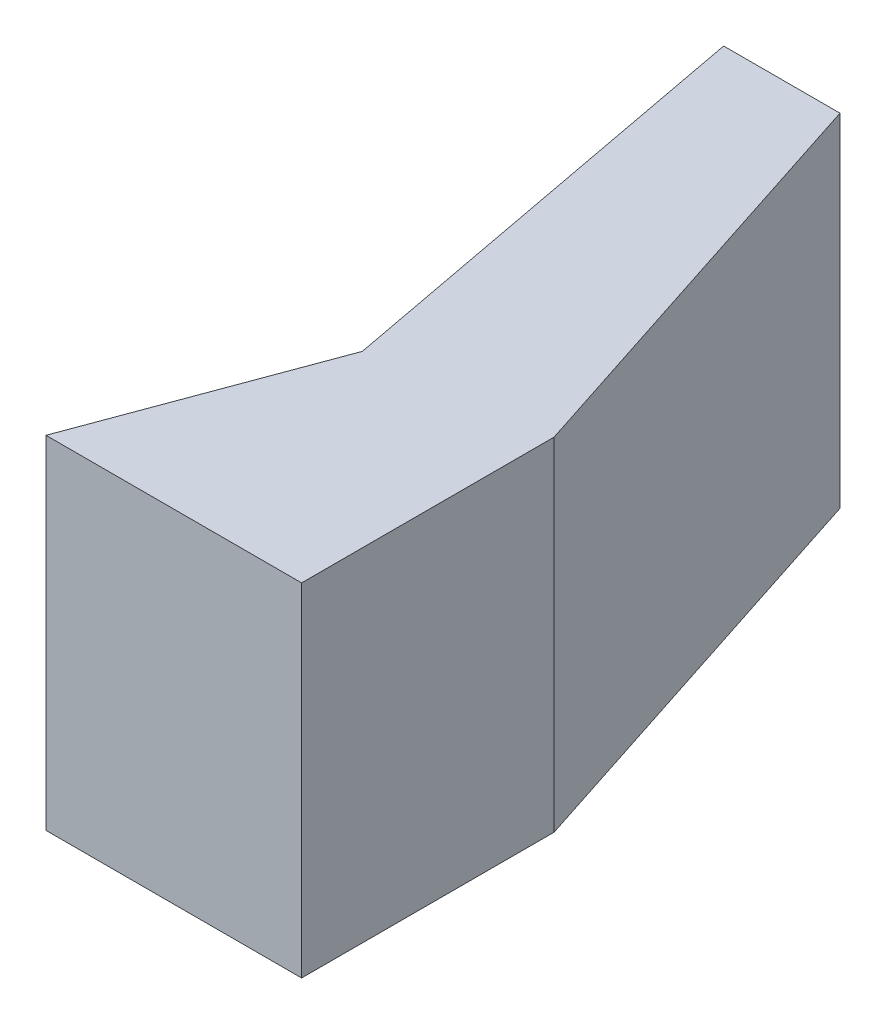
ISO-10303-21;
HEADER;
FILE_DESCRIPTION(('STEP AP214'),'2;1');
FILE_NAME('part.step','',(''),(''),'','','');
FILE_SCHEMA(('AUTOMOTIVE_DESIGN { 1 0 10303 214 1 1 1 1 }'));
ENDSEC;
DATA;
#1=APPLICATION_CONTEXT('core data for automotive mechanical design processes');
#2=APPLICATION_PROTOCOL_DEFINITION('international standard','automotive_design',2000,#1);
#3=PRODUCT_CONTEXT('',#1,'mechanical');
#4=PRODUCT('Part','Part','',(#3));
#5=PRODUCT_RELATED_PRODUCT_CATEGORY('part','',(#4));
#6=PRODUCT_DEFINITION_FORMATION('','',#4);
#7=PRODUCT_DEFINITION_CONTEXT('part definition',#1,'design');
#8=PRODUCT_DEFINITION('design','',#6,#7);
#9=PRODUCT_DEFINITION_SHAPE('','',#8);
#10=(LENGTH_UNIT() NAMED_UNIT(*) SI_UNIT(.MILLI.,.METRE.));
#11=(NAMED_UNIT(*) PLANE_ANGLE_UNIT() SI_UNIT($,.RADIAN.));
#12=(NAMED_UNIT(*) SI_UNIT($,.STERADIAN.) SOLID_ANGLE_UNIT());
#13=UNCERTAINTY_MEASURE_WITH_UNIT(LENGTH_MEASURE(1.E-05),#10,'distance_accuracy_value','');
#14=(GEOMETRIC_REPRESENTATION_CONTEXT(3) GLOBAL_UNCERTAINTY_ASSIGNED_CONTEXT((#13)) GLOBAL_UNIT_ASSIGNED_CONTEXT((#10,
#11,#12)) REPRESENTATION_CONTEXT('',''));
#15=CARTESIAN_POINT('',(0.,0.,0.));
#16=DIRECTION('',(0.,0.,1.));
#17=DIRECTION('',(1.,0.,0.));
#18=AXIS2_PLACEMENT_3D('',#15,#16,#17);
#19=CARTESIAN_POINT('',(0.,0.,0.));
#20=DIRECTION('',(0.,-1.,0.));
#21=DIRECTION('',(0.,0.,-1.));
#22=AXIS2_PLACEMENT_3D('',#19,#20,#21);
#23=PLANE('',#22);
#24=DIRECTION('',(0.,0.,-1.));
#25=VECTOR('',#24,1.);
#26=CARTESIAN_POINT('',(23.002372200557,0.,-14.192126517734));
#27=LINE('',#26,#25);
#28=CARTESIAN_POINT('',(23.002372200557,0.,47.057873482266));
#29=VERTEX_POINT('',#28);
#30=CARTESIAN_POINT('',(23.002372200557,0.,-14.192126517734));
#31=VERTEX_POINT('',#30);
#32=EDGE_CURVE('E205',#29,#31,#27,.T.);
#33=ORIENTED_EDGE('',*,*,#32,.F.);
#34=DIRECTION('',(1.,0.,0.));
#35=VECTOR('',#34,1.);
#36=CARTESIAN_POINT('',(23.002372200557,0.,47.057873482266));
#37=LINE('',#36,#35);
#38=CARTESIAN_POINT('',(-38.997627799443,0.,47.057873482266));
#39=VERTEX_POINT('',#38);
#40=EDGE_CURVE('E58',#39,#29,#37,.T.);
#41=ORIENTED_EDGE('',*,*,#40,.F.);
#42=DIRECTION('',(-0.347263015428623,0.,0.937767774086644));
#43=VECTOR('',#42,1.);
#44=CARTESIAN_POINT('',(-38.997627799443,0.,47.057873482266));
#45=LINE('',#44,#43);
#46=CARTESIAN_POINT('',(-18.2646737230859,0.,-8.93051379366682));
#47=VERTEX_POINT('',#46);
#48=EDGE_CURVE('E133',#47,#39,#45,.T.);
#49=ORIENTED_EDGE('',*,*,#48,.F.);
#50=DIRECTION('',(0.184980577052595,0.,0.982742176826297));
#51=VECTOR('',#50,1.);
#52=CARTESIAN_POINT('',(-18.2646737230859,0.,-8.93051379366682));
#53=LINE('',#52,#51);
#54=CARTESIAN_POINT('',(-38.5888348447447,0.,-116.906230277611));
#55=VERTEX_POINT('',#54);
#56=EDGE_CURVE('E212',#55,#47,#53,.T.);
#57=ORIENTED_EDGE('',*,*,#56,.F.);
#58=DIRECTION('',(-1.,0.,0.));
#59=VECTOR('',#58,1.);
#60=CARTESIAN_POINT('',(-38.5888348447447,0.,-116.906230277611));
#61=LINE('',#60,#59);
#62=CARTESIAN_POINT('',(-10.3714631919374,0.,-116.906230277611));
#63=VERTEX_POINT('',#62);
#64=EDGE_CURVE('E210',#63,#55,#61,.T.);
#65=ORIENTED_EDGE('',*,*,#64,.F.);
#66=DIRECTION('',(-0.309016994374949,0.,-0.951056516295153));
#67=VECTOR('',#66,1.);
#68=CARTESIAN_POINT('',(-10.3714631919374,0.,-116.906230277611));
#69=LINE('',#68,#67);
#70=EDGE_CURVE('E208',#31,#63,#69,.T.);
#71=ORIENTED_EDGE('',*,*,#70,.F.);
#72=EDGE_LOOP('',(#33,#41,#49,#57,#65,#71));
#73=FACE_BOUND('',#72,.T.);
#74=DIRECTION('',(0.184980577052596,0.,0.982742176826297));
#75=VECTOR('',#74,1.);
#76=CARTESIAN_POINT('',(-36.177255073376,0.,-114.906230277611));
#77=LINE('',#76,#75);
#78=CARTESIAN_POINT('',(-36.177255073376,0.,-114.906230277611));
#79=VERTEX_POINT('',#78);
#80=CARTESIAN_POINT('',(-16.1966595941276,0.,-8.75576730235923));
#81=VERTEX_POINT('',#80);
#82=EDGE_CURVE('E163',#79,#81,#77,.T.);
#83=ORIENTED_EDGE('',*,*,#82,.T.);
#84=DIRECTION('',(-0.347263015428623,0.,0.937767774086645));
#85=VECTOR('',#84,1.);
#86=CARTESIAN_POINT('',(-16.1966595941276,0.,-8.75576730235923));
#87=LINE('',#86,#85);
#88=CARTESIAN_POINT('',(-36.1242873997032,0.,45.057873482266));
#89=VERTEX_POINT('',#88);
#90=EDGE_CURVE('E50',#81,#89,#87,.T.);
#91=ORIENTED_EDGE('',*,*,#90,.T.);
#92=DIRECTION('',(1.,0.,0.));
#93=VECTOR('',#92,1.);
#94=CARTESIAN_POINT('',(-36.1242873997032,0.,45.057873482266));
#95=LINE('',#94,#93);
#96=CARTESIAN_POINT('',(21.002372200557,0.,45.057873482266));
#97=VERTEX_POINT('',#96);
#98=EDGE_CURVE('E180',#89,#97,#95,.T.);
#99=ORIENTED_EDGE('',*,*,#98,.T.);
#100=DIRECTION('',(0.,0.,-1.));
#101=VECTOR('',#100,1.);
#102=CARTESIAN_POINT('',(21.002372200557,0.,45.057873482266));
#103=LINE('',#102,#101);
#104=CARTESIAN_POINT('',(21.002372200557,0.,-13.8753576370849));
#105=VERTEX_POINT('',#104);
#106=EDGE_CURVE('E183',#97,#105,#103,.T.);
#107=ORIENTED_EDGE('',*,*,#106,.T.);
#108=DIRECTION('',(-0.309016994374949,0.,-0.951056516295153));
#109=VECTOR('',#108,1.);
#110=CARTESIAN_POINT('',(21.002372200557,0.,-13.8753576370849));
#111=LINE('',#110,#109);
#112=CARTESIAN_POINT('',(-11.8245482479482,0.,-114.906230277611));
#113=VERTEX_POINT('',#112);
#114=EDGE_CURVE('E186',#105,#113,#111,.T.);
#115=ORIENTED_EDGE('',*,*,#114,.T.);
#116=DIRECTION('',(-1.,0.,0.));
#117=VECTOR('',#116,1.);
#118=CARTESIAN_POINT('',(-11.8245482479482,0.,-114.906230277611));
#119=LINE('',#118,#117);
#120=EDGE_CURVE('E189',#113,#79,#119,.T.);
#121=ORIENTED_EDGE('',*,*,#120,.T.);
#122=EDGE_LOOP('',(#83,#91,#99,#107,#115,#121));
#123=FACE_BOUND('',#122,.T.);
#124=ADVANCED_FACE('F35',(#73,#123),#23,.T.);
#125=CARTESIAN_POINT('',(23.002372200557,81.,-14.192126517734));
#126=DIRECTION('',(-1.,0.,0.));
#127=DIRECTION('',(0.,0.,1.));
#128=AXIS2_PLACEMENT_3D('',#125,#126,#127);
#129=PLANE('',#128);
#130=ORIENTED_EDGE('',*,*,#32,.T.);
#131=DIRECTION('',(0.,-1.,0.));
#132=VECTOR('',#131,1.);
#133=CARTESIAN_POINT('',(23.002372200557,81.,-14.192126517734));
#134=LINE('',#133,#132);
#135=CARTESIAN_POINT('',(23.002372200557,83.,-14.192126517734));
#136=VERTEX_POINT('',#135);
#137=EDGE_CURVE('E11',#136,#31,#134,.T.);
#138=ORIENTED_EDGE('',*,*,#137,.F.);
#139=DIRECTION('',(0.,0.,-1.));
#140=VECTOR('',#139,1.);
#141=CARTESIAN_POINT('',(23.002372200557,83.,47.057873482266));
#142=LINE('',#141,#140);
#143=CARTESIAN_POINT('',(23.002372200557,83.,47.057873482266));
#144=VERTEX_POINT('',#143);
#145=EDGE_CURVE('E143',#144,#136,#142,.T.);
#146=ORIENTED_EDGE('',*,*,#145,.F.);
#147=DIRECTION('',(0.,-1.,0.));
#148=VECTOR('',#147,1.);
#149=CARTESIAN_POINT('',(23.002372200557,81.,47.057873482266));
#150=LINE('',#149,#148);
#151=EDGE_CURVE('E135',#144,#29,#150,.T.);
#152=ORIENTED_EDGE('',*,*,#151,.T.);
#153=EDGE_LOOP('',(#130,#138,#146,#152));
#154=FACE_BOUND('',#153,.T.);
#155=ADVANCED_FACE('F37',(#154),#129,.F.);
#156=CARTESIAN_POINT('',(-10.3714631919374,81.,-116.906230277611));
#157=DIRECTION('',(-0.951056516295153,0.,0.309016994374949));
#158=DIRECTION('',(0.309016994374949,0.,0.951056516295153));
#159=AXIS2_PLACEMENT_3D('',#156,#157,#158);
#160=PLANE('',#159);
#161=ORIENTED_EDGE('',*,*,#70,.T.);
#162=DIRECTION('',(0.,-1.,0.));
#163=VECTOR('',#162,1.);
#164=CARTESIAN_POINT('',(-10.3714631919374,81.,-116.906230277611));
#165=LINE('',#164,#163);
#166=CARTESIAN_POINT('',(-10.3714631919374,83.,-116.906230277611));
#167=VERTEX_POINT('',#166);
#168=EDGE_CURVE('E43',#167,#63,#165,.T.);
#169=ORIENTED_EDGE('',*,*,#168,.F.);
#170=DIRECTION('',(-0.309016994374949,0.,-0.951056516295153));
#171=VECTOR('',#170,1.);
#172=CARTESIAN_POINT('',(23.002372200557,83.,-14.192126517734));
#173=LINE('',#172,#171);
#174=EDGE_CURVE('E153',#136,#167,#173,.T.);
#175=ORIENTED_EDGE('',*,*,#174,.F.);
#176=ORIENTED_EDGE('',*,*,#137,.T.);
#177=EDGE_LOOP('',(#161,#169,#175,#176));
#178=FACE_BOUND('',#177,.T.);
#179=ADVANCED_FACE('F233',(#178),#160,.F.);
#180=CARTESIAN_POINT('',(-38.5888348447447,81.,-116.906230277611));
#181=DIRECTION('',(0.,0.,1.));
#182=DIRECTION('',(1.,0.,0.));
#183=AXIS2_PLACEMENT_3D('',#180,#181,#182);
#184=PLANE('',#183);
#185=ORIENTED_EDGE('',*,*,#64,.T.);
#186=DIRECTION('',(0.,-1.,0.));
#187=VECTOR('',#186,1.);
#188=CARTESIAN_POINT('',(-38.5888348447447,81.,-116.906230277611));
#189=LINE('',#188,#187);
#190=CARTESIAN_POINT('',(-38.5888348447447,83.,-116.906230277611));
#191=VERTEX_POINT('',#190);
#192=EDGE_CURVE('E218',#191,#55,#189,.T.);
#193=ORIENTED_EDGE('',*,*,#192,.F.);
#194=DIRECTION('',(-1.,0.,0.));
#195=VECTOR('',#194,1.);
#196=CARTESIAN_POINT('',(-10.3714631919374,83.,-116.906230277611));
#197=LINE('',#196,#195);
#198=EDGE_CURVE('E156',#167,#191,#197,.T.);
#199=ORIENTED_EDGE('',*,*,#198,.F.);
#200=ORIENTED_EDGE('',*,*,#168,.T.);
#201=EDGE_LOOP('',(#185,#193,#199,#200));
#202=FACE_BOUND('',#201,.T.);
#203=ADVANCED_FACE('F224',(#202),#184,.F.);
#204=CARTESIAN_POINT('',(-18.2646737230859,81.,-8.93051379366682));
#205=DIRECTION('',(0.982742176826297,0.,-0.184980577052595));
#206=DIRECTION('',(-0.184980577052595,0.,-0.982742176826297));
#207=AXIS2_PLACEMENT_3D('',#204,#205,#206);
#208=PLANE('',#207);
#209=ORIENTED_EDGE('',*,*,#56,.T.);
#210=DIRECTION('',(0.,-1.,0.));
#211=VECTOR('',#210,1.);
#212=CARTESIAN_POINT('',(-18.2646737230859,81.,-8.93051379366682));
#213=LINE('',#212,#211);
#214=CARTESIAN_POINT('',(-18.2646737230859,83.,-8.93051379366682));
#215=VERTEX_POINT('',#214);
#216=EDGE_CURVE('E134',#215,#47,#213,.T.);
#217=ORIENTED_EDGE('',*,*,#216,.F.);
#218=DIRECTION('',(0.184980577052595,0.,0.982742176826297));
#219=VECTOR('',#218,1.);
#220=CARTESIAN_POINT('',(-38.5888348447447,83.,-116.906230277611));
#221=LINE('',#220,#219);
#222=EDGE_CURVE('E149',#191,#215,#221,.T.);
#223=ORIENTED_EDGE('',*,*,#222,.F.);
#224=ORIENTED_EDGE('',*,*,#192,.T.);
#225=EDGE_LOOP('',(#209,#217,#223,#224));
#226=FACE_BOUND('',#225,.T.);
#227=ADVANCED_FACE('F232',(#226),#208,.F.);
#228=CARTESIAN_POINT('',(-38.997627799443,81.,47.057873482266));
#229=DIRECTION('',(0.937767774086645,0.,0.347263015428623));
#230=DIRECTION('',(0.347263015428623,0.,-0.937767774086645));
#231=AXIS2_PLACEMENT_3D('',#228,#229,#230);
#232=PLANE('',#231);
#233=ORIENTED_EDGE('',*,*,#48,.T.);
#234=DIRECTION('',(0.,-1.,0.));
#235=VECTOR('',#234,1.);
#236=CARTESIAN_POINT('',(-38.997627799443,81.,47.057873482266));
#237=LINE('',#236,#235);
#238=CARTESIAN_POINT('',(-38.997627799443,83.,47.057873482266));
#239=VERTEX_POINT('',#238);
#240=EDGE_CURVE('E126',#239,#39,#237,.T.);
#241=ORIENTED_EDGE('',*,*,#240,.F.);
#242=DIRECTION('',(-0.347263015428623,0.,0.937767774086644));
#243=VECTOR('',#242,1.);
#244=CARTESIAN_POINT('',(-18.2646737230859,83.,-8.93051379366682));
#245=LINE('',#244,#243);
#246=EDGE_CURVE('E131',#215,#239,#245,.T.);
#247=ORIENTED_EDGE('',*,*,#246,.F.);
#248=ORIENTED_EDGE('',*,*,#216,.T.);
#249=EDGE_LOOP('',(#233,#241,#247,#248));
#250=FACE_BOUND('',#249,.T.);
#251=ADVANCED_FACE('F128',(#250),#232,.F.);
#252=CARTESIAN_POINT('',(23.002372200557,81.,47.057873482266));
#253=DIRECTION('',(0.,0.,-1.));
#254=DIRECTION('',(-1.,0.,0.));
#255=AXIS2_PLACEMENT_3D('',#252,#253,#254);
#256=PLANE('',#255);
#257=ORIENTED_EDGE('',*,*,#40,.T.);
#258=ORIENTED_EDGE('',*,*,#151,.F.);
#259=DIRECTION('',(1.,0.,0.));
#260=VECTOR('',#259,1.);
#261=CARTESIAN_POINT('',(-38.997627799443,83.,47.057873482266));
#262=LINE('',#261,#260);
#263=EDGE_CURVE('E138',#239,#144,#262,.T.);
#264=ORIENTED_EDGE('',*,*,#263,.F.);
#265=ORIENTED_EDGE('',*,*,#240,.T.);
#266=EDGE_LOOP('',(#257,#258,#264,#265));
#267=FACE_BOUND('',#266,.T.);
#268=ADVANCED_FACE('F139',(#267),#256,.F.);
#269=CARTESIAN_POINT('',(-16.1966595941276,81.,-8.75576730235923));
#270=DIRECTION('',(0.937767774086645,0.,0.347263015428623));
#271=DIRECTION('',(0.347263015428623,0.,-0.937767774086645));
#272=AXIS2_PLACEMENT_3D('',#269,#270,#271);
#273=PLANE('',#272);
#274=ORIENTED_EDGE('',*,*,#90,.F.);
#275=DIRECTION('',(0.,-1.,0.));
#276=VECTOR('',#275,1.);
#277=CARTESIAN_POINT('',(-16.1966595941276,81.,-8.75576730235923));
#278=LINE('',#277,#276);
#279=CARTESIAN_POINT('',(-16.1966595941276,81.,-8.75576730235923));
#280=VERTEX_POINT('',#279);
#281=EDGE_CURVE('E178',#280,#81,#278,.T.);
#282=ORIENTED_EDGE('',*,*,#281,.F.);
#283=DIRECTION('',(-0.347263015428623,0.,0.937767774086645));
#284=VECTOR('',#283,1.);
#285=CARTESIAN_POINT('',(-16.1966595941276,81.,-8.75576730235923));
#286=LINE('',#285,#284);
#287=CARTESIAN_POINT('',(-36.1242873997032,81.,45.057873482266));
#288=VERTEX_POINT('',#287);
#289=EDGE_CURVE('E159',#280,#288,#286,.T.);
#290=ORIENTED_EDGE('',*,*,#289,.T.);
#291=DIRECTION('',(0.,-1.,0.));
#292=VECTOR('',#291,1.);
#293=CARTESIAN_POINT('',(-36.1242873997032,81.,45.057873482266));
#294=LINE('',#293,#292);
#295=EDGE_CURVE('E203',#288,#89,#294,.T.);
#296=ORIENTED_EDGE('',*,*,#295,.T.);
#297=EDGE_LOOP('',(#274,#282,#290,#296));
#298=FACE_BOUND('',#297,.T.);
#299=ADVANCED_FACE('F245',(#298),#273,.T.);
#300=CARTESIAN_POINT('',(-36.1242873997032,81.,45.057873482266));
#301=DIRECTION('',(0.,0.,-1.));
#302=DIRECTION('',(-1.,0.,0.));
#303=AXIS2_PLACEMENT_3D('',#300,#301,#302);
#304=PLANE('',#303);
#305=ORIENTED_EDGE('',*,*,#98,.F.);
#306=ORIENTED_EDGE('',*,*,#295,.F.);
#307=DIRECTION('',(1.,0.,0.));
#308=VECTOR('',#307,1.);
#309=CARTESIAN_POINT('',(-36.1242873997032,81.,45.057873482266));
#310=LINE('',#309,#308);
#311=CARTESIAN_POINT('',(21.002372200557,81.,45.057873482266));
#312=VERTEX_POINT('',#311);
#313=EDGE_CURVE('E162',#288,#312,#310,.T.);
#314=ORIENTED_EDGE('',*,*,#313,.T.);
#315=DIRECTION('',(0.,-1.,0.));
#316=VECTOR('',#315,1.);
#317=CARTESIAN_POINT('',(21.002372200557,81.,45.057873482266));
#318=LINE('',#317,#316);
#319=EDGE_CURVE('E201',#312,#97,#318,.T.);
#320=ORIENTED_EDGE('',*,*,#319,.T.);
#321=EDGE_LOOP('',(#305,#306,#314,#320));
#322=FACE_BOUND('',#321,.T.);
#323=ADVANCED_FACE('F276',(#322),#304,.T.);
#324=CARTESIAN_POINT('',(21.002372200557,81.,45.057873482266));
#325=DIRECTION('',(-1.,0.,0.));
#326=DIRECTION('',(0.,0.,1.));
#327=AXIS2_PLACEMENT_3D('',#324,#325,#326);
#328=PLANE('',#327);
#329=ORIENTED_EDGE('',*,*,#106,.F.);
#330=ORIENTED_EDGE('',*,*,#319,.F.);
#331=DIRECTION('',(0.,0.,-1.));
#332=VECTOR('',#331,1.);
#333=CARTESIAN_POINT('',(21.002372200557,81.,45.057873482266));
#334=LINE('',#333,#332);
#335=CARTESIAN_POINT('',(21.002372200557,81.,-13.8753576370849));
#336=VERTEX_POINT('',#335);
#337=EDGE_CURVE('E166',#312,#336,#334,.T.);
#338=ORIENTED_EDGE('',*,*,#337,.T.);
#339=DIRECTION('',(0.,-1.,0.));
#340=VECTOR('',#339,1.);
#341=CARTESIAN_POINT('',(21.002372200557,81.,-13.8753576370849));
#342=LINE('',#341,#340);
#343=EDGE_CURVE('E199',#336,#105,#342,.T.);
#344=ORIENTED_EDGE('',*,*,#343,.T.);
#345=EDGE_LOOP('',(#329,#330,#338,#344));
#346=FACE_BOUND('',#345,.T.);
#347=ADVANCED_FACE('F282',(#346),#328,.T.);
#348=CARTESIAN_POINT('',(21.002372200557,81.,-13.8753576370849));
#349=DIRECTION('',(-0.951056516295153,0.,0.309016994374949));
#350=DIRECTION('',(0.309016994374949,0.,0.951056516295153));
#351=AXIS2_PLACEMENT_3D('',#348,#349,#350);
#352=PLANE('',#351);
#353=ORIENTED_EDGE('',*,*,#114,.F.);
#354=ORIENTED_EDGE('',*,*,#343,.F.);
#355=DIRECTION('',(-0.309016994374949,0.,-0.951056516295153));
#356=VECTOR('',#355,1.);
#357=CARTESIAN_POINT('',(21.002372200557,81.,-13.8753576370849));
#358=LINE('',#357,#356);
#359=CARTESIAN_POINT('',(-11.8245482479482,81.,-114.906230277611));
#360=VERTEX_POINT('',#359);
#361=EDGE_CURVE('E169',#336,#360,#358,.T.);
#362=ORIENTED_EDGE('',*,*,#361,.T.);
#363=DIRECTION('',(0.,-1.,0.));
#364=VECTOR('',#363,1.);
#365=CARTESIAN_POINT('',(-11.8245482479482,81.,-114.906230277611));
#366=LINE('',#365,#364);
#367=EDGE_CURVE('E197',#360,#113,#366,.T.);
#368=ORIENTED_EDGE('',*,*,#367,.T.);
#369=EDGE_LOOP('',(#353,#354,#362,#368));
#370=FACE_BOUND('',#369,.T.);
#371=ADVANCED_FACE('F289',(#370),#352,.T.);
#372=CARTESIAN_POINT('',(-11.8245482479482,81.,-114.906230277611));
#373=DIRECTION('',(0.,0.,1.));
#374=DIRECTION('',(1.,0.,0.));
#375=AXIS2_PLACEMENT_3D('',#372,#373,#374);
#376=PLANE('',#375);
#377=ORIENTED_EDGE('',*,*,#120,.F.);
#378=ORIENTED_EDGE('',*,*,#367,.F.);
#379=DIRECTION('',(-1.,0.,0.));
#380=VECTOR('',#379,1.);
#381=CARTESIAN_POINT('',(-11.8245482479482,81.,-114.906230277611));
#382=LINE('',#381,#380);
#383=CARTESIAN_POINT('',(-36.1772550733759,81.,-114.906230277611));
#384=VERTEX_POINT('',#383);
#385=EDGE_CURVE('E172',#360,#384,#382,.T.);
#386=ORIENTED_EDGE('',*,*,#385,.T.);
#387=DIRECTION('',(0.,-1.,0.));
#388=VECTOR('',#387,1.);
#389=CARTESIAN_POINT('',(-36.177255073376,81.,-114.906230277611));
#390=LINE('',#389,#388);
#391=EDGE_CURVE('E195',#384,#79,#390,.T.);
#392=ORIENTED_EDGE('',*,*,#391,.T.);
#393=EDGE_LOOP('',(#377,#378,#386,#392));
#394=FACE_BOUND('',#393,.T.);
#395=ADVANCED_FACE('F297',(#394),#376,.T.);
#396=CARTESIAN_POINT('',(-36.177255073376,81.,-114.906230277611));
#397=DIRECTION('',(0.982742176826297,0.,-0.184980577052596));
#398=DIRECTION('',(-0.184980577052596,0.,-0.982742176826297));
#399=AXIS2_PLACEMENT_3D('',#396,#397,#398);
#400=PLANE('',#399);
#401=ORIENTED_EDGE('',*,*,#82,.F.);
#402=ORIENTED_EDGE('',*,*,#391,.F.);
#403=DIRECTION('',(0.184980577052596,0.,0.982742176826297));
#404=VECTOR('',#403,1.);
#405=CARTESIAN_POINT('',(-36.177255073376,81.,-114.906230277611));
#406=LINE('',#405,#404);
#407=EDGE_CURVE('E175',#384,#280,#406,.T.);
#408=ORIENTED_EDGE('',*,*,#407,.T.);
#409=ORIENTED_EDGE('',*,*,#281,.T.);
#410=EDGE_LOOP('',(#401,#402,#408,#409));
#411=FACE_BOUND('',#410,.T.);
#412=ADVANCED_FACE('F305',(#411),#400,.T.);
#413=CARTESIAN_POINT('',(0.,81.,0.));
#414=DIRECTION('',(0.,1.,0.));
#415=DIRECTION('',(0.,0.,1.));
#416=AXIS2_PLACEMENT_3D('',#413,#414,#415);
#417=PLANE('',#416);
#418=ORIENTED_EDGE('',*,*,#289,.F.);
#419=ORIENTED_EDGE('',*,*,#407,.F.);
#420=ORIENTED_EDGE('',*,*,#385,.F.);
#421=ORIENTED_EDGE('',*,*,#361,.F.);
#422=ORIENTED_EDGE('',*,*,#337,.F.);
#423=ORIENTED_EDGE('',*,*,#313,.F.);
#424=EDGE_LOOP('',(#418,#419,#420,#421,#422,#423));
#425=FACE_BOUND('',#424,.T.);
#426=ADVANCED_FACE('F313',(#425),#417,.F.);
#427=CARTESIAN_POINT('',(0.,83.,0.));
#428=DIRECTION('',(0.,1.,0.));
#429=DIRECTION('',(0.,0.,1.));
#430=AXIS2_PLACEMENT_3D('',#427,#428,#429);
#431=PLANE('',#430);
#432=ORIENTED_EDGE('',*,*,#246,.T.);
#433=ORIENTED_EDGE('',*,*,#263,.T.);
#434=ORIENTED_EDGE('',*,*,#145,.T.);
#435=ORIENTED_EDGE('',*,*,#174,.T.);
#436=ORIENTED_EDGE('',*,*,#198,.T.);
#437=ORIENTED_EDGE('',*,*,#222,.T.);
#438=EDGE_LOOP('',(#432,#433,#434,#435,#436,#437));
#439=FACE_BOUND('',#438,.T.);
#440=ADVANCED_FACE('F146',(#439),#431,.T.);
#441=CLOSED_SHELL('',(#124,#155,#179,#203,#227,#251,#268,#299,#323,#347,#371,#395,#412,#426,#440));
#442=MANIFOLD_SOLID_BREP('B2',#441);
#443=ADVANCED_BREP_SHAPE_REPRESENTATION('',(#18,#442),#14);
#444=SHAPE_DEFINITION_REPRESENTATION(#9,#443);
ENDSEC;
END-ISO-10303-21;
